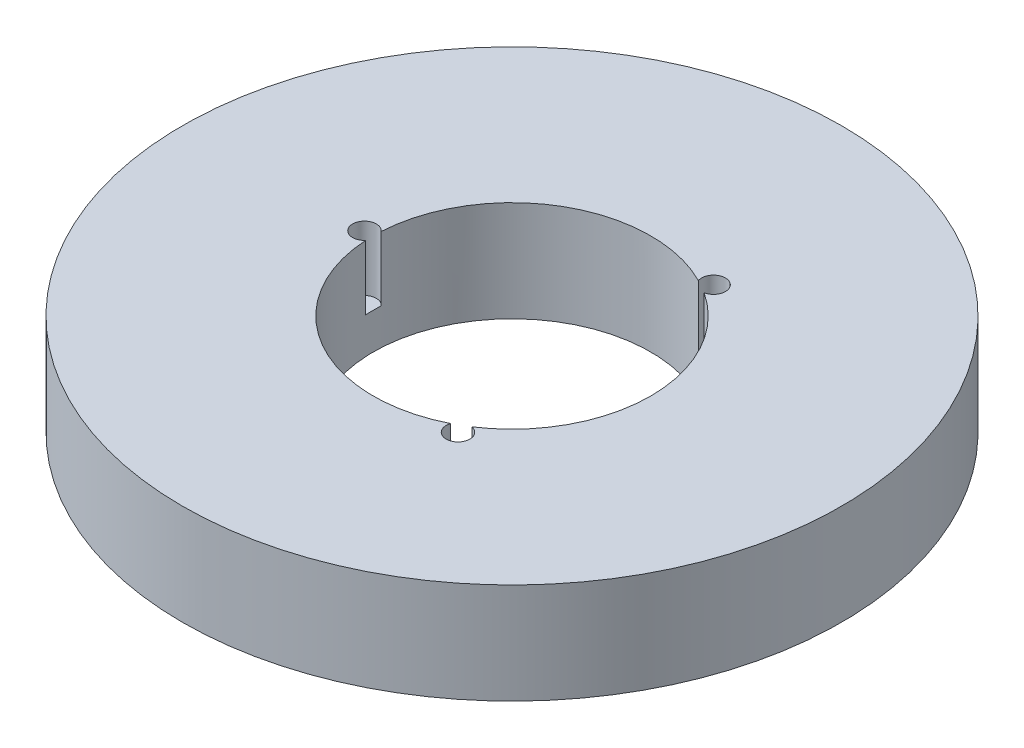
ISO-10303-21;
HEADER;
FILE_DESCRIPTION(('STEP AP214'),'2;1');
FILE_NAME('part.step','',(''),(''),'','','');
FILE_SCHEMA(('AUTOMOTIVE_DESIGN { 1 0 10303 214 1 1 1 1 }'));
ENDSEC;
DATA;
#1=APPLICATION_CONTEXT('core data for automotive mechanical design processes');
#2=APPLICATION_PROTOCOL_DEFINITION('international standard','automotive_design',2000,#1);
#3=PRODUCT_CONTEXT('',#1,'mechanical');
#4=PRODUCT('Part','Part','',(#3));
#5=PRODUCT_RELATED_PRODUCT_CATEGORY('part','',(#4));
#6=PRODUCT_DEFINITION_FORMATION('','',#4);
#7=PRODUCT_DEFINITION_CONTEXT('part definition',#1,'design');
#8=PRODUCT_DEFINITION('design','',#6,#7);
#9=PRODUCT_DEFINITION_SHAPE('','',#8);
#10=(LENGTH_UNIT() NAMED_UNIT(*) SI_UNIT(.MILLI.,.METRE.));
#11=(NAMED_UNIT(*) PLANE_ANGLE_UNIT() SI_UNIT($,.RADIAN.));
#12=(NAMED_UNIT(*) SI_UNIT($,.STERADIAN.) SOLID_ANGLE_UNIT());
#13=UNCERTAINTY_MEASURE_WITH_UNIT(LENGTH_MEASURE(1.E-05),#10,'distance_accuracy_value','');
#14=(GEOMETRIC_REPRESENTATION_CONTEXT(3) GLOBAL_UNCERTAINTY_ASSIGNED_CONTEXT((#13)) GLOBAL_UNIT_ASSIGNED_CONTEXT((#10,
#11,#12)) REPRESENTATION_CONTEXT('',''));
#15=CARTESIAN_POINT('',(0.,0.,0.));
#16=DIRECTION('',(0.,0.,1.));
#17=DIRECTION('',(1.,0.,0.));
#18=AXIS2_PLACEMENT_3D('',#15,#16,#17);
#19=CARTESIAN_POINT('',(0.,29.,0.));
#20=DIRECTION('',(0.,-1.,0.));
#21=DIRECTION('',(0.,0.,-1.));
#22=AXIS2_PLACEMENT_3D('',#19,#20,#21);
#23=CYLINDRICAL_SURFACE('',#22,95.);
#24=CARTESIAN_POINT('',(0.,29.,0.));
#25=DIRECTION('',(0.,1.,0.));
#26=DIRECTION('',(0.,0.,1.));
#27=AXIS2_PLACEMENT_3D('',#24,#25,#26);
#28=CIRCLE('',#27,95.);
#29=CARTESIAN_POINT('',(0.,29.,-95.));
#30=VERTEX_POINT('',#29);
#31=EDGE_CURVE('E126',#30,#30,#28,.T.);
#32=CARTESIAN_POINT('',(0.,0.,0.));
#33=DIRECTION('',(0.,1.,0.));
#34=DIRECTION('',(0.,0.,1.));
#35=AXIS2_PLACEMENT_3D('',#32,#33,#34);
#36=CIRCLE('',#35,95.);
#37=CARTESIAN_POINT('',(0.,0.,-95.));
#38=VERTEX_POINT('',#37);
#39=EDGE_CURVE('E124',#38,#38,#36,.T.);
#40=CARTESIAN_POINT('',(0.,29.,-95.));
#41=CARTESIAN_POINT('',(0.,28.6979166666667,-95.));
#42=CARTESIAN_POINT('',(0.,28.3958333333333,-95.));
#43=CARTESIAN_POINT('',(0.,27.7916666666667,-95.));
#44=CARTESIAN_POINT('',(0.,27.4895833333333,-95.));
#45=CARTESIAN_POINT('',(0.,26.8854166666667,-95.));
#46=CARTESIAN_POINT('',(0.,26.5833333333333,-95.));
#47=CARTESIAN_POINT('',(0.,25.9791666666667,-95.));
#48=CARTESIAN_POINT('',(0.,25.6770833333333,-95.));
#49=CARTESIAN_POINT('',(0.,25.0729166666667,-95.));
#50=CARTESIAN_POINT('',(0.,24.7708333333333,-95.));
#51=CARTESIAN_POINT('',(0.,24.1666666666667,-95.));
#52=CARTESIAN_POINT('',(0.,23.8645833333333,-95.));
#53=CARTESIAN_POINT('',(0.,23.2604166666667,-95.));
#54=CARTESIAN_POINT('',(0.,22.9583333333333,-95.));
#55=CARTESIAN_POINT('',(0.,22.3541666666667,-95.));
#56=CARTESIAN_POINT('',(0.,22.0520833333333,-95.));
#57=CARTESIAN_POINT('',(0.,21.4479166666667,-95.));
#58=CARTESIAN_POINT('',(0.,21.1458333333333,-95.));
#59=CARTESIAN_POINT('',(0.,20.5416666666667,-95.));
#60=CARTESIAN_POINT('',(0.,20.2395833333333,-95.));
#61=CARTESIAN_POINT('',(0.,19.6354166666667,-95.));
#62=CARTESIAN_POINT('',(0.,19.3333333333333,-95.));
#63=CARTESIAN_POINT('',(0.,18.7291666666667,-95.));
#64=CARTESIAN_POINT('',(0.,18.4270833333333,-95.));
#65=CARTESIAN_POINT('',(0.,17.8229166666667,-95.));
#66=CARTESIAN_POINT('',(0.,17.5208333333333,-95.));
#67=CARTESIAN_POINT('',(0.,16.9166666666667,-95.));
#68=CARTESIAN_POINT('',(0.,16.6145833333333,-95.));
#69=CARTESIAN_POINT('',(0.,16.0104166666667,-95.));
#70=CARTESIAN_POINT('',(0.,15.7083333333333,-95.));
#71=CARTESIAN_POINT('',(0.,15.1041666666667,-95.));
#72=CARTESIAN_POINT('',(0.,14.8020833333333,-95.));
#73=CARTESIAN_POINT('',(0.,14.1979166666667,-95.));
#74=CARTESIAN_POINT('',(0.,13.8958333333333,-95.));
#75=CARTESIAN_POINT('',(0.,13.2916666666667,-95.));
#76=CARTESIAN_POINT('',(0.,12.9895833333333,-95.));
#77=CARTESIAN_POINT('',(0.,12.3854166666667,-95.));
#78=CARTESIAN_POINT('',(0.,12.0833333333333,-95.));
#79=CARTESIAN_POINT('',(0.,11.4791666666667,-95.));
#80=CARTESIAN_POINT('',(0.,11.1770833333333,-95.));
#81=CARTESIAN_POINT('',(0.,10.5729166666667,-95.));
#82=CARTESIAN_POINT('',(0.,10.2708333333333,-95.));
#83=CARTESIAN_POINT('',(0.,9.66666666666667,-95.));
#84=CARTESIAN_POINT('',(0.,9.36458333333333,-95.));
#85=CARTESIAN_POINT('',(0.,8.76041666666667,-95.));
#86=CARTESIAN_POINT('',(0.,8.45833333333333,-95.));
#87=CARTESIAN_POINT('',(0.,7.85416666666667,-95.));
#88=CARTESIAN_POINT('',(0.,7.55208333333333,-95.));
#89=CARTESIAN_POINT('',(0.,6.94791666666667,-95.));
#90=CARTESIAN_POINT('',(0.,6.64583333333333,-95.));
#91=CARTESIAN_POINT('',(0.,6.04166666666667,-95.));
#92=CARTESIAN_POINT('',(0.,5.73958333333333,-95.));
#93=CARTESIAN_POINT('',(0.,5.13541666666667,-95.));
#94=CARTESIAN_POINT('',(0.,4.83333333333333,-95.));
#95=CARTESIAN_POINT('',(0.,4.22916666666667,-95.));
#96=CARTESIAN_POINT('',(0.,3.92708333333333,-95.));
#97=CARTESIAN_POINT('',(0.,3.32291666666667,-95.));
#98=CARTESIAN_POINT('',(0.,3.02083333333333,-95.));
#99=CARTESIAN_POINT('',(0.,2.41666666666667,-95.));
#100=CARTESIAN_POINT('',(0.,2.11458333333333,-95.));
#101=CARTESIAN_POINT('',(0.,1.51041666666667,-95.));
#102=CARTESIAN_POINT('',(0.,1.20833333333333,-95.));
#103=CARTESIAN_POINT('',(0.,0.604166666666667,-95.));
#104=CARTESIAN_POINT('',(0.,0.302083333333333,-95.));
#105=CARTESIAN_POINT('',(0.,0.,-95.));
#106=B_SPLINE_CURVE_WITH_KNOTS('',3,(#40,#41,#42,#43,#44,#45,#46,#47,#48,#49,#50,#51,#52,#53,
#54,#55,#56,#57,#58,#59,#60,#61,#62,#63,#64,#65,#66,#67,#68,#69,#70,#71,#72,#73,#74,#75,#76,#77,
#78,#79,#80,#81,#82,#83,#84,#85,#86,#87,#88,#89,#90,#91,#92,#93,#94,#95,#96,#97,#98,#99,#100,
#101,#102,#103,#104,#105),.UNSPECIFIED.,.F.,.F.,(4,2,2,2,2,2,2,2,2,2,2,2,2,2,2,2,2,2,2,2,2,2,2,
2,2,2,2,2,2,2,2,2,4),(0.,0.906249999999997,1.8125,2.71875,3.625,4.53125,5.4375,6.34375,7.25,
8.15625,9.0625,9.96875,10.875,11.78125,12.6875,13.59375,14.5,15.40625,16.3125,17.21875,18.125,
19.03125,19.9375,20.84375,21.75,22.65625,23.5625,24.46875,25.375,26.28125,27.1875,28.09375,29.),.UNSPECIFIED.);
#107=EDGE_CURVE('BSEAM39',#30,#38,#106,.T.);
#108=ORIENTED_EDGE('',*,*,#31,.F.);
#109=ORIENTED_EDGE('',*,*,#39,.T.);
#110=ORIENTED_EDGE('',*,*,#107,.T.);
#111=ORIENTED_EDGE('',*,*,#107,.F.);
#112=EDGE_LOOP('',(#108,#110,#109,#111));
#113=FACE_BOUND('',#112,.T.);
#114=ADVANCED_FACE('F39',(#113),#23,.T.);
#115=CARTESIAN_POINT('',(0.,29.,0.));
#116=DIRECTION('',(0.,1.,0.));
#117=DIRECTION('',(0.,0.,1.));
#118=AXIS2_PLACEMENT_3D('',#115,#116,#117);
#119=PLANE('',#118);
#120=CARTESIAN_POINT('',(21.2639391381392,29.,36.8302229563091));
#121=DIRECTION('',(0.,1.,0.));
#122=DIRECTION('',(0.866025403784436,0.,-0.500000000000004));
#123=AXIS2_PLACEMENT_3D('',#120,#121,#122);
#124=CIRCLE('',#123,3.41665343294602);
#125=CARTESIAN_POINT('',(18.0391526107347,29.,35.7013861507732));
#126=VERTEX_POINT('',#125);
#127=CARTESIAN_POINT('',(21.8987310515205,29.,33.4730574990271));
#128=VERTEX_POINT('',#127);
#129=EDGE_CURVE('E147',#126,#128,#124,.T.);
#130=ORIENTED_EDGE('',*,*,#129,.F.);
#131=CARTESIAN_POINT('',(0.,29.,0.));
#132=DIRECTION('',(0.,1.,0.));
#133=DIRECTION('',(0.,0.,1.));
#134=AXIS2_PLACEMENT_3D('',#131,#132,#133);
#135=CIRCLE('',#134,40.);
#136=CARTESIAN_POINT('',(-39.9378836622549,29.,2.22832865174616));
#137=VERTEX_POINT('',#136);
#138=EDGE_CURVE('E118',#137,#126,#135,.T.);
#139=ORIENTED_EDGE('',*,*,#138,.F.);
#140=CARTESIAN_POINT('',(-42.5278782762781,29.,0.));
#141=DIRECTION('',(0.,1.,0.));
#142=DIRECTION('',(0.,0.,1.));
#143=AXIS2_PLACEMENT_3D('',#140,#141,#142);
#144=CIRCLE('',#143,3.41665343294602);
#145=CARTESIAN_POINT('',(-39.9378836622549,29.,-2.22832865174616));
#146=VERTEX_POINT('',#145);
#147=EDGE_CURVE('E113',#146,#137,#144,.T.);
#148=ORIENTED_EDGE('',*,*,#147,.F.);
#149=CARTESIAN_POINT('',(18.0391526107342,29.,-35.7013861507735));
#150=VERTEX_POINT('',#149);
#151=EDGE_CURVE('E106',#150,#146,#135,.T.);
#152=ORIENTED_EDGE('',*,*,#151,.F.);
#153=CARTESIAN_POINT('',(21.2639391381387,29.,-36.8302229563094));
#154=DIRECTION('',(0.,1.,0.));
#155=DIRECTION('',(-0.866025403784443,0.,-0.499999999999992));
#156=AXIS2_PLACEMENT_3D('',#153,#154,#155);
#157=CIRCLE('',#156,3.41665343294602);
#158=CARTESIAN_POINT('',(21.89873105152,29.,-33.4730574990274));
#159=VERTEX_POINT('',#158);
#160=EDGE_CURVE('E90',#159,#150,#157,.T.);
#161=ORIENTED_EDGE('',*,*,#160,.F.);
#162=EDGE_CURVE('E116',#128,#159,#135,.T.);
#163=ORIENTED_EDGE('',*,*,#162,.F.);
#164=EDGE_LOOP('',(#130,#139,#148,#152,#161,#163));
#165=FACE_BOUND('',#164,.T.);
#166=ORIENTED_EDGE('',*,*,#31,.T.);
#167=EDGE_LOOP('',(#166));
#168=FACE_BOUND('',#167,.T.);
#169=ADVANCED_FACE('F115',(#165,#168),#119,.T.);
#170=CARTESIAN_POINT('',(0.,0.,0.));
#171=DIRECTION('',(0.,1.,0.));
#172=DIRECTION('',(0.,0.,1.));
#173=AXIS2_PLACEMENT_3D('',#170,#171,#172);
#174=PLANE('',#173);
#175=CARTESIAN_POINT('',(0.,0.,0.));
#176=DIRECTION('',(0.,1.,0.));
#177=DIRECTION('',(0.,0.,1.));
#178=AXIS2_PLACEMENT_3D('',#175,#176,#177);
#179=CIRCLE('',#178,40.);
#180=CARTESIAN_POINT('',(0.,0.,40.));
#181=VERTEX_POINT('',#180);
#182=EDGE_CURVE('E120',#181,#181,#179,.T.);
#183=ORIENTED_EDGE('',*,*,#182,.T.);
#184=EDGE_LOOP('',(#183));
#185=FACE_BOUND('',#184,.T.);
#186=ORIENTED_EDGE('',*,*,#39,.F.);
#187=EDGE_LOOP('',(#186));
#188=FACE_BOUND('',#187,.T.);
#189=ADVANCED_FACE('F164',(#185,#188),#174,.F.);
#190=CARTESIAN_POINT('',(0.,29.,0.));
#191=DIRECTION('',(0.,-1.,0.));
#192=DIRECTION('',(0.,0.,-1.));
#193=AXIS2_PLACEMENT_3D('',#190,#191,#192);
#194=CYLINDRICAL_SURFACE('',#193,40.);
#195=DIRECTION('',(0.,1.,0.));
#196=VECTOR('',#195,1.);
#197=CARTESIAN_POINT('',(18.0391526107347,19.7096768924126,35.7013861507733));
#198=LINE('',#197,#196);
#199=CARTESIAN_POINT('',(18.0391526107347,10.4193537848252,35.7013861507732));
#200=VERTEX_POINT('',#199);
#201=EDGE_CURVE('E11',#200,#126,#198,.T.);
#202=ORIENTED_EDGE('',*,*,#201,.F.);
#203=CARTESIAN_POINT('',(0.,10.4193537848252,0.));
#204=DIRECTION('',(0.,1.,0.));
#205=DIRECTION('',(0.,0.,1.));
#206=AXIS2_PLACEMENT_3D('',#203,#204,#205);
#207=CIRCLE('',#206,40.);
#208=CARTESIAN_POINT('',(21.8987310515205,10.4193537848252,33.4730574990271));
#209=VERTEX_POINT('',#208);
#210=EDGE_CURVE('E144',#200,#209,#207,.T.);
#211=ORIENTED_EDGE('',*,*,#210,.T.);
#212=DIRECTION('',(0.,1.,0.));
#213=VECTOR('',#212,1.);
#214=CARTESIAN_POINT('',(21.8987310515205,19.7096768924126,33.4730574990271));
#215=LINE('',#214,#213);
#216=EDGE_CURVE('E46',#128,#209,#215,.F.);
#217=ORIENTED_EDGE('',*,*,#216,.F.);
#218=ORIENTED_EDGE('',*,*,#162,.T.);
#219=DIRECTION('',(0.,1.,0.));
#220=VECTOR('',#219,1.);
#221=CARTESIAN_POINT('',(21.8987310515201,19.7096768924126,-33.4730574990274));
#222=LINE('',#221,#220);
#223=CARTESIAN_POINT('',(21.89873105152,10.4193537848252,-33.4730574990274));
#224=VERTEX_POINT('',#223);
#225=EDGE_CURVE('E92',#224,#159,#222,.T.);
#226=ORIENTED_EDGE('',*,*,#225,.F.);
#227=CARTESIAN_POINT('',(0.,10.4193537848252,0.));
#228=DIRECTION('',(0.,1.,0.));
#229=DIRECTION('',(0.,0.,1.));
#230=AXIS2_PLACEMENT_3D('',#227,#228,#229);
#231=CIRCLE('',#230,40.);
#232=CARTESIAN_POINT('',(18.0391526107342,10.4193537848252,-35.7013861507735));
#233=VERTEX_POINT('',#232);
#234=EDGE_CURVE('E107',#224,#233,#231,.T.);
#235=ORIENTED_EDGE('',*,*,#234,.T.);
#236=DIRECTION('',(0.,1.,0.));
#237=VECTOR('',#236,1.);
#238=CARTESIAN_POINT('',(18.0391526107342,19.7096768924126,-35.7013861507735));
#239=LINE('',#238,#237);
#240=EDGE_CURVE('E95',#150,#233,#239,.F.);
#241=ORIENTED_EDGE('',*,*,#240,.F.);
#242=ORIENTED_EDGE('',*,*,#151,.T.);
#243=DIRECTION('',(0.,1.,0.));
#244=VECTOR('',#243,1.);
#245=CARTESIAN_POINT('',(-39.9378836622549,19.7096768924126,-2.22832865174617));
#246=LINE('',#245,#244);
#247=CARTESIAN_POINT('',(-39.9378836622549,10.4193537848252,-2.22832865174616));
#248=VERTEX_POINT('',#247);
#249=EDGE_CURVE('E143',#248,#146,#246,.T.);
#250=ORIENTED_EDGE('',*,*,#249,.F.);
#251=CARTESIAN_POINT('',(0.,10.4193537848252,0.));
#252=DIRECTION('',(0.,1.,0.));
#253=DIRECTION('',(0.,0.,1.));
#254=AXIS2_PLACEMENT_3D('',#251,#252,#253);
#255=CIRCLE('',#254,40.);
#256=CARTESIAN_POINT('',(-39.9378836622549,10.4193537848252,2.22832865174616));
#257=VERTEX_POINT('',#256);
#258=EDGE_CURVE('E132',#248,#257,#255,.T.);
#259=ORIENTED_EDGE('',*,*,#258,.T.);
#260=DIRECTION('',(0.,1.,0.));
#261=VECTOR('',#260,1.);
#262=CARTESIAN_POINT('',(-39.9378836622549,19.7096768924126,2.22832865174617));
#263=LINE('',#262,#261);
#264=EDGE_CURVE('E137',#137,#257,#263,.F.);
#265=ORIENTED_EDGE('',*,*,#264,.F.);
#266=ORIENTED_EDGE('',*,*,#138,.T.);
#267=EDGE_LOOP('',(#202,#211,#217,#218,#226,#235,#241,#242,#250,#259,#265,#266));
#268=FACE_BOUND('',#267,.T.);
#269=ORIENTED_EDGE('',*,*,#182,.F.);
#270=EDGE_LOOP('',(#269));
#271=FACE_BOUND('',#270,.T.);
#272=ADVANCED_FACE('F103',(#268,#271),#194,.F.);
#273=CARTESIAN_POINT('',(-42.5278782762781,10.4193537848252,0.));
#274=DIRECTION('',(0.,1.,0.));
#275=DIRECTION('',(0.,0.,1.));
#276=AXIS2_PLACEMENT_3D('',#273,#274,#275);
#277=CYLINDRICAL_SURFACE('',#276,3.41665343294602);
#278=ORIENTED_EDGE('',*,*,#249,.T.);
#279=ORIENTED_EDGE('',*,*,#147,.T.);
#280=ORIENTED_EDGE('',*,*,#264,.T.);
#281=CARTESIAN_POINT('',(-42.5278782762781,10.4193537848252,0.));
#282=DIRECTION('',(0.,1.,0.));
#283=DIRECTION('',(0.,0.,1.));
#284=AXIS2_PLACEMENT_3D('',#281,#282,#283);
#285=CIRCLE('',#284,3.41665343294602);
#286=EDGE_CURVE('E121',#248,#257,#285,.T.);
#287=ORIENTED_EDGE('',*,*,#286,.F.);
#288=EDGE_LOOP('',(#278,#279,#280,#287));
#289=FACE_BOUND('',#288,.T.);
#290=ADVANCED_FACE('F174',(#289),#277,.F.);
#291=CARTESIAN_POINT('',(-42.5278782762781,10.4193537848252,0.));
#292=DIRECTION('',(0.,1.,0.));
#293=DIRECTION('',(0.,0.,1.));
#294=AXIS2_PLACEMENT_3D('',#291,#292,#293);
#295=PLANE('',#294);
#296=ORIENTED_EDGE('',*,*,#286,.T.);
#297=ORIENTED_EDGE('',*,*,#258,.F.);
#298=EDGE_LOOP('',(#296,#297));
#299=FACE_BOUND('',#298,.T.);
#300=ADVANCED_FACE('F177',(#299),#295,.T.);
#301=CARTESIAN_POINT('',(21.2639391381387,10.4193537848252,-36.8302229563094));
#302=DIRECTION('',(0.,1.,0.));
#303=DIRECTION('',(0.,0.,1.));
#304=AXIS2_PLACEMENT_3D('',#301,#302,#303);
#305=CYLINDRICAL_SURFACE('',#304,3.41665343294602);
#306=ORIENTED_EDGE('',*,*,#225,.T.);
#307=ORIENTED_EDGE('',*,*,#160,.T.);
#308=ORIENTED_EDGE('',*,*,#240,.T.);
#309=CARTESIAN_POINT('',(21.2639391381387,10.4193537848252,-36.8302229563094));
#310=DIRECTION('',(0.,1.,0.));
#311=DIRECTION('',(-0.866025403784443,0.,-0.499999999999992));
#312=AXIS2_PLACEMENT_3D('',#309,#310,#311);
#313=CIRCLE('',#312,3.41665343294602);
#314=EDGE_CURVE('E56',#224,#233,#313,.T.);
#315=ORIENTED_EDGE('',*,*,#314,.F.);
#316=EDGE_LOOP('',(#306,#307,#308,#315));
#317=FACE_BOUND('',#316,.T.);
#318=ADVANCED_FACE('F93',(#317),#305,.F.);
#319=CARTESIAN_POINT('',(21.2639391381387,10.4193537848252,-36.8302229563094));
#320=DIRECTION('',(0.,1.,0.));
#321=DIRECTION('',(-0.866025403784443,0.,-0.499999999999992));
#322=AXIS2_PLACEMENT_3D('',#319,#320,#321);
#323=PLANE('',#322);
#324=ORIENTED_EDGE('',*,*,#314,.T.);
#325=ORIENTED_EDGE('',*,*,#234,.F.);
#326=EDGE_LOOP('',(#324,#325));
#327=FACE_BOUND('',#326,.T.);
#328=ADVANCED_FACE('F160',(#327),#323,.T.);
#329=CARTESIAN_POINT('',(21.2639391381392,10.4193537848252,36.8302229563091));
#330=DIRECTION('',(0.,1.,0.));
#331=DIRECTION('',(0.,0.,1.));
#332=AXIS2_PLACEMENT_3D('',#329,#330,#331);
#333=CYLINDRICAL_SURFACE('',#332,3.41665343294602);
#334=ORIENTED_EDGE('',*,*,#201,.T.);
#335=ORIENTED_EDGE('',*,*,#129,.T.);
#336=ORIENTED_EDGE('',*,*,#216,.T.);
#337=CARTESIAN_POINT('',(21.2639391381392,10.4193537848252,36.8302229563091));
#338=DIRECTION('',(0.,1.,0.));
#339=DIRECTION('',(0.866025403784436,0.,-0.500000000000004));
#340=AXIS2_PLACEMENT_3D('',#337,#338,#339);
#341=CIRCLE('',#340,3.41665343294602);
#342=EDGE_CURVE('E55',#200,#209,#341,.T.);
#343=ORIENTED_EDGE('',*,*,#342,.F.);
#344=EDGE_LOOP('',(#334,#335,#336,#343));
#345=FACE_BOUND('',#344,.T.);
#346=ADVANCED_FACE('F149',(#345),#333,.F.);
#347=CARTESIAN_POINT('',(21.2639391381392,10.4193537848252,36.8302229563091));
#348=DIRECTION('',(0.,1.,0.));
#349=DIRECTION('',(0.866025403784436,0.,-0.500000000000004));
#350=AXIS2_PLACEMENT_3D('',#347,#348,#349);
#351=PLANE('',#350);
#352=ORIENTED_EDGE('',*,*,#342,.T.);
#353=ORIENTED_EDGE('',*,*,#210,.F.);
#354=EDGE_LOOP('',(#352,#353));
#355=FACE_BOUND('',#354,.T.);
#356=ADVANCED_FACE('F151',(#355),#351,.T.);
#357=CLOSED_SHELL('',(#114,#169,#189,#272,#290,#300,#318,#328,#346,#356));
#358=MANIFOLD_SOLID_BREP('B2',#357);
#359=ADVANCED_BREP_SHAPE_REPRESENTATION('',(#18,#358),#14);
#360=SHAPE_DEFINITION_REPRESENTATION(#9,#359);
ENDSEC;
END-ISO-10303-21;
